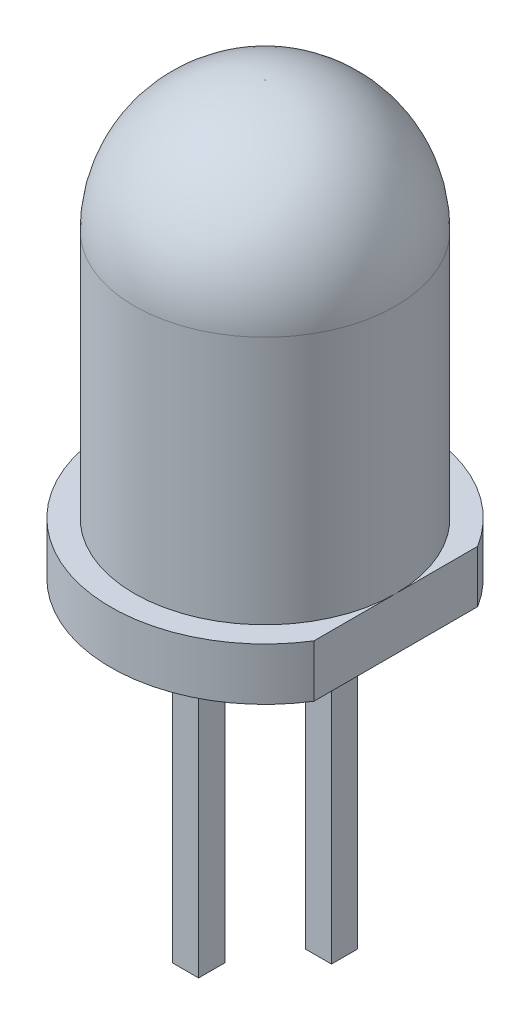
ISO-10303-21;
HEADER;
FILE_DESCRIPTION(('STEP AP214'),'2;1');
FILE_NAME('part.step','',(''),(''),'','','');
FILE_SCHEMA(('AUTOMOTIVE_DESIGN { 1 0 10303 214 1 1 1 1 }'));
ENDSEC;
DATA;
#1=APPLICATION_CONTEXT('core data for automotive mechanical design processes');
#2=APPLICATION_PROTOCOL_DEFINITION('international standard','automotive_design',2000,#1);
#3=PRODUCT_CONTEXT('',#1,'mechanical');
#4=PRODUCT('Part','Part','',(#3));
#5=PRODUCT_RELATED_PRODUCT_CATEGORY('part','',(#4));
#6=PRODUCT_DEFINITION_FORMATION('','',#4);
#7=PRODUCT_DEFINITION_CONTEXT('part definition',#1,'design');
#8=PRODUCT_DEFINITION('design','',#6,#7);
#9=PRODUCT_DEFINITION_SHAPE('','',#8);
#10=(LENGTH_UNIT() NAMED_UNIT(*) SI_UNIT(.MILLI.,.METRE.));
#11=(NAMED_UNIT(*) PLANE_ANGLE_UNIT() SI_UNIT($,.RADIAN.));
#12=(NAMED_UNIT(*) SI_UNIT($,.STERADIAN.) SOLID_ANGLE_UNIT());
#13=UNCERTAINTY_MEASURE_WITH_UNIT(LENGTH_MEASURE(1.E-05),#10,'distance_accuracy_value','');
#14=(GEOMETRIC_REPRESENTATION_CONTEXT(3) GLOBAL_UNCERTAINTY_ASSIGNED_CONTEXT((#13)) GLOBAL_UNIT_ASSIGNED_CONTEXT((#10,
#11,#12)) REPRESENTATION_CONTEXT('',''));
#15=CARTESIAN_POINT('',(0.,0.,0.));
#16=DIRECTION('',(0.,0.,1.));
#17=DIRECTION('',(1.,0.,0.));
#18=AXIS2_PLACEMENT_3D('',#15,#16,#17);
#19=CARTESIAN_POINT('',(0.520172722818679,-0.5,0.));
#20=DIRECTION('',(0.,0.,-1.));
#21=DIRECTION('',(-1.,0.,0.));
#22=AXIS2_PLACEMENT_3D('',#19,#20,#21);
#23=CYLINDRICAL_SURFACE('',#22,0.5);
#24=CARTESIAN_POINT('',(0.520172722818679,-0.5,0.75));
#25=DIRECTION('',(-0.707106781186547,0.,-0.707106781186547));
#26=DIRECTION('',(-0.707106781186547,0.,0.707106781186547));
#27=AXIS2_PLACEMENT_3D('',#24,#25,#26);
#28=ELLIPSE('',#27,0.707106781186547,0.5);
#29=CARTESIAN_POINT('',(0.520172722818679,0.,0.75));
#30=VERTEX_POINT('',#29);
#31=CARTESIAN_POINT('',(1.02017272281868,-0.5,0.25));
#32=VERTEX_POINT('',#31);
#33=EDGE_CURVE('E226',#30,#32,#28,.T.);
#34=ORIENTED_EDGE('',*,*,#33,.F.);
#35=DIRECTION('',(0.,0.,1.));
#36=VECTOR('',#35,1.);
#37=CARTESIAN_POINT('',(0.520172722818679,0.,0.));
#38=LINE('',#37,#36);
#39=CARTESIAN_POINT('',(0.520172722818679,0.,-0.75));
#40=VERTEX_POINT('',#39);
#41=EDGE_CURVE('E198',#40,#30,#38,.T.);
#42=ORIENTED_EDGE('',*,*,#41,.F.);
#43=CARTESIAN_POINT('',(0.520172722818679,-0.5,-0.75));
#44=DIRECTION('',(0.707106781186547,0.,-0.707106781186547));
#45=DIRECTION('',(-0.707106781186547,0.,-0.707106781186547));
#46=AXIS2_PLACEMENT_3D('',#43,#44,#45);
#47=ELLIPSE('',#46,0.707106781186547,0.5);
#48=CARTESIAN_POINT('',(1.02017272281868,-0.5,-0.25));
#49=VERTEX_POINT('',#48);
#50=EDGE_CURVE('E59',#40,#49,#47,.T.);
#51=ORIENTED_EDGE('',*,*,#50,.T.);
#52=DIRECTION('',(0.,0.,1.));
#53=VECTOR('',#52,1.);
#54=CARTESIAN_POINT('',(1.02017272281868,-0.5,0.));
#55=LINE('',#54,#53);
#56=EDGE_CURVE('E219',#32,#49,#55,.F.);
#57=ORIENTED_EDGE('',*,*,#56,.F.);
#58=EDGE_LOOP('',(#34,#42,#51,#57));
#59=FACE_BOUND('',#58,.T.);
#60=ADVANCED_FACE('F36',(#59),#23,.F.);
#61=CARTESIAN_POINT('',(0.,-0.5,-0.75));
#62=DIRECTION('',(1.,0.,0.));
#63=DIRECTION('',(0.,0.,-1.));
#64=AXIS2_PLACEMENT_3D('',#61,#62,#63);
#65=CYLINDRICAL_SURFACE('',#64,0.5);
#66=ORIENTED_EDGE('',*,*,#50,.F.);
#67=DIRECTION('',(-1.,0.,0.));
#68=VECTOR('',#67,1.);
#69=CARTESIAN_POINT('',(0.,0.,-0.75));
#70=LINE('',#69,#68);
#71=CARTESIAN_POINT('',(2.02017272281868,0.,-0.75));
#72=VERTEX_POINT('',#71);
#73=EDGE_CURVE('E201',#72,#40,#70,.T.);
#74=ORIENTED_EDGE('',*,*,#73,.F.);
#75=CARTESIAN_POINT('',(2.02017272281868,-0.5,-0.75));
#76=DIRECTION('',(0.707106781186547,0.,0.707106781186547));
#77=DIRECTION('',(0.707106781186547,0.,-0.707106781186547));
#78=AXIS2_PLACEMENT_3D('',#75,#76,#77);
#79=ELLIPSE('',#78,0.707106781186547,0.5);
#80=CARTESIAN_POINT('',(1.52017272281868,-0.5,-0.25));
#81=VERTEX_POINT('',#80);
#82=EDGE_CURVE('E223',#72,#81,#79,.T.);
#83=ORIENTED_EDGE('',*,*,#82,.T.);
#84=DIRECTION('',(-1.,0.,0.));
#85=VECTOR('',#84,1.);
#86=CARTESIAN_POINT('',(0.,-0.5,-0.25));
#87=LINE('',#86,#85);
#88=EDGE_CURVE('E216',#49,#81,#87,.F.);
#89=ORIENTED_EDGE('',*,*,#88,.F.);
#90=EDGE_LOOP('',(#66,#74,#83,#89));
#91=FACE_BOUND('',#90,.T.);
#92=ADVANCED_FACE('F242',(#91),#65,.F.);
#93=CARTESIAN_POINT('',(2.02017272281868,-0.5,0.));
#94=DIRECTION('',(0.,0.,1.));
#95=DIRECTION('',(1.,0.,0.));
#96=AXIS2_PLACEMENT_3D('',#93,#94,#95);
#97=CYLINDRICAL_SURFACE('',#96,0.5);
#98=ORIENTED_EDGE('',*,*,#82,.F.);
#99=DIRECTION('',(0.,0.,-1.));
#100=VECTOR('',#99,1.);
#101=CARTESIAN_POINT('',(2.02017272281868,0.,0.));
#102=LINE('',#101,#100);
#103=CARTESIAN_POINT('',(2.02017272281868,0.,0.75));
#104=VERTEX_POINT('',#103);
#105=EDGE_CURVE('E204',#104,#72,#102,.T.);
#106=ORIENTED_EDGE('',*,*,#105,.F.);
#107=CARTESIAN_POINT('',(2.02017272281868,-0.5,0.75));
#108=DIRECTION('',(-0.707106781186547,0.,0.707106781186547));
#109=DIRECTION('',(0.707106781186547,0.,0.707106781186547));
#110=AXIS2_PLACEMENT_3D('',#107,#108,#109);
#111=ELLIPSE('',#110,0.707106781186547,0.5);
#112=CARTESIAN_POINT('',(1.52017272281868,-0.5,0.25));
#113=VERTEX_POINT('',#112);
#114=EDGE_CURVE('E221',#104,#113,#111,.T.);
#115=ORIENTED_EDGE('',*,*,#114,.T.);
#116=DIRECTION('',(0.,0.,-1.));
#117=VECTOR('',#116,1.);
#118=CARTESIAN_POINT('',(1.52017272281868,-0.5,0.));
#119=LINE('',#118,#117);
#120=EDGE_CURVE('E213',#81,#113,#119,.F.);
#121=ORIENTED_EDGE('',*,*,#120,.F.);
#122=EDGE_LOOP('',(#98,#106,#115,#121));
#123=FACE_BOUND('',#122,.T.);
#124=ADVANCED_FACE('F246',(#123),#97,.F.);
#125=CARTESIAN_POINT('',(0.,-0.5,0.75));
#126=DIRECTION('',(-1.,0.,0.));
#127=DIRECTION('',(0.,0.,1.));
#128=AXIS2_PLACEMENT_3D('',#125,#126,#127);
#129=CYLINDRICAL_SURFACE('',#128,0.5);
#130=DIRECTION('',(1.,0.,0.));
#131=VECTOR('',#130,1.);
#132=CARTESIAN_POINT('',(0.,0.,0.75));
#133=LINE('',#132,#131);
#134=EDGE_CURVE('E207',#30,#104,#133,.T.);
#135=ORIENTED_EDGE('',*,*,#134,.F.);
#136=ORIENTED_EDGE('',*,*,#33,.T.);
#137=DIRECTION('',(1.,0.,0.));
#138=VECTOR('',#137,1.);
#139=CARTESIAN_POINT('',(0.,-0.5,0.25));
#140=LINE('',#139,#138);
#141=EDGE_CURVE('E210',#113,#32,#140,.F.);
#142=ORIENTED_EDGE('',*,*,#141,.F.);
#143=ORIENTED_EDGE('',*,*,#114,.F.);
#144=EDGE_LOOP('',(#135,#136,#142,#143));
#145=FACE_BOUND('',#144,.T.);
#146=ADVANCED_FACE('F252',(#145),#129,.F.);
#147=CARTESIAN_POINT('',(0.,-0.5,0.75));
#148=DIRECTION('',(-1.,0.,0.));
#149=DIRECTION('',(0.,0.,1.));
#150=AXIS2_PLACEMENT_3D('',#147,#148,#149);
#151=CYLINDRICAL_SURFACE('',#150,0.5);
#152=CARTESIAN_POINT('',(-0.520142923068885,-0.5,0.75));
#153=DIRECTION('',(-0.707106781186547,0.,0.707106781186547));
#154=DIRECTION('',(0.707106781186547,0.,0.707106781186547));
#155=AXIS2_PLACEMENT_3D('',#152,#153,#154);
#156=ELLIPSE('',#155,0.707106781186547,0.5);
#157=CARTESIAN_POINT('',(-0.520142923068885,0.,0.75));
#158=VERTEX_POINT('',#157);
#159=CARTESIAN_POINT('',(-1.02014292306889,-0.5,0.25));
#160=VERTEX_POINT('',#159);
#161=EDGE_CURVE('E196',#158,#160,#156,.T.);
#162=ORIENTED_EDGE('',*,*,#161,.F.);
#163=DIRECTION('',(1.,0.,0.));
#164=VECTOR('',#163,1.);
#165=CARTESIAN_POINT('',(0.,0.,0.75));
#166=LINE('',#165,#164);
#167=CARTESIAN_POINT('',(-2.02014292306889,0.,0.75));
#168=VERTEX_POINT('',#167);
#169=EDGE_CURVE('E160',#168,#158,#166,.T.);
#170=ORIENTED_EDGE('',*,*,#169,.F.);
#171=CARTESIAN_POINT('',(-2.02014292306889,-0.5,0.75));
#172=DIRECTION('',(-0.707106781186547,0.,-0.707106781186547));
#173=DIRECTION('',(-0.707106781186547,0.,0.707106781186547));
#174=AXIS2_PLACEMENT_3D('',#171,#172,#173);
#175=ELLIPSE('',#174,0.707106781186547,0.5);
#176=CARTESIAN_POINT('',(-1.52014292306889,-0.5,0.25));
#177=VERTEX_POINT('',#176);
#178=EDGE_CURVE('E194',#168,#177,#175,.T.);
#179=ORIENTED_EDGE('',*,*,#178,.T.);
#180=DIRECTION('',(1.,0.,0.));
#181=VECTOR('',#180,1.);
#182=CARTESIAN_POINT('',(0.,-0.5,0.25));
#183=LINE('',#182,#181);
#184=EDGE_CURVE('E187',#160,#177,#183,.F.);
#185=ORIENTED_EDGE('',*,*,#184,.F.);
#186=EDGE_LOOP('',(#162,#170,#179,#185));
#187=FACE_BOUND('',#186,.T.);
#188=ADVANCED_FACE('F256',(#187),#151,.F.);
#189=CARTESIAN_POINT('',(-2.02014292306889,-0.5,0.));
#190=DIRECTION('',(0.,0.,-1.));
#191=DIRECTION('',(-1.,0.,0.));
#192=AXIS2_PLACEMENT_3D('',#189,#190,#191);
#193=CYLINDRICAL_SURFACE('',#192,0.5);
#194=ORIENTED_EDGE('',*,*,#178,.F.);
#195=DIRECTION('',(0.,0.,1.));
#196=VECTOR('',#195,1.);
#197=CARTESIAN_POINT('',(-2.02014292306889,0.,0.));
#198=LINE('',#197,#196);
#199=CARTESIAN_POINT('',(-2.02014292306889,0.,-0.75));
#200=VERTEX_POINT('',#199);
#201=EDGE_CURVE('E164',#200,#168,#198,.T.);
#202=ORIENTED_EDGE('',*,*,#201,.F.);
#203=CARTESIAN_POINT('',(-2.02014292306889,-0.5,-0.75));
#204=DIRECTION('',(0.707106781186547,0.,-0.707106781186547));
#205=DIRECTION('',(-0.707106781186547,0.,-0.707106781186547));
#206=AXIS2_PLACEMENT_3D('',#203,#204,#205);
#207=ELLIPSE('',#206,0.707106781186547,0.5);
#208=CARTESIAN_POINT('',(-1.52014292306889,-0.5,-0.25));
#209=VERTEX_POINT('',#208);
#210=EDGE_CURVE('E192',#200,#209,#207,.T.);
#211=ORIENTED_EDGE('',*,*,#210,.T.);
#212=DIRECTION('',(0.,0.,1.));
#213=VECTOR('',#212,1.);
#214=CARTESIAN_POINT('',(-1.52014292306889,-0.5,0.));
#215=LINE('',#214,#213);
#216=EDGE_CURVE('E184',#177,#209,#215,.F.);
#217=ORIENTED_EDGE('',*,*,#216,.F.);
#218=EDGE_LOOP('',(#194,#202,#211,#217));
#219=FACE_BOUND('',#218,.T.);
#220=ADVANCED_FACE('F260',(#219),#193,.F.);
#221=CARTESIAN_POINT('',(0.,-0.5,-0.75));
#222=DIRECTION('',(1.,0.,0.));
#223=DIRECTION('',(0.,0.,-1.));
#224=AXIS2_PLACEMENT_3D('',#221,#222,#223);
#225=CYLINDRICAL_SURFACE('',#224,0.5);
#226=ORIENTED_EDGE('',*,*,#210,.F.);
#227=DIRECTION('',(-1.,0.,0.));
#228=VECTOR('',#227,1.);
#229=CARTESIAN_POINT('',(0.,0.,-0.75));
#230=LINE('',#229,#228);
#231=CARTESIAN_POINT('',(-0.520142923068885,0.,-0.75));
#232=VERTEX_POINT('',#231);
#233=EDGE_CURVE('E172',#232,#200,#230,.T.);
#234=ORIENTED_EDGE('',*,*,#233,.F.);
#235=CARTESIAN_POINT('',(-0.520142923068885,-0.5,-0.75));
#236=DIRECTION('',(0.707106781186547,0.,0.707106781186547));
#237=DIRECTION('',(0.707106781186547,0.,-0.707106781186547));
#238=AXIS2_PLACEMENT_3D('',#235,#236,#237);
#239=ELLIPSE('',#238,0.707106781186547,0.5);
#240=CARTESIAN_POINT('',(-1.02014292306889,-0.5,-0.25));
#241=VERTEX_POINT('',#240);
#242=EDGE_CURVE('E190',#232,#241,#239,.T.);
#243=ORIENTED_EDGE('',*,*,#242,.T.);
#244=DIRECTION('',(-1.,0.,0.));
#245=VECTOR('',#244,1.);
#246=CARTESIAN_POINT('',(0.,-0.5,-0.25));
#247=LINE('',#246,#245);
#248=EDGE_CURVE('E181',#209,#241,#247,.F.);
#249=ORIENTED_EDGE('',*,*,#248,.F.);
#250=EDGE_LOOP('',(#226,#234,#243,#249));
#251=FACE_BOUND('',#250,.T.);
#252=ADVANCED_FACE('F264',(#251),#225,.F.);
#253=CARTESIAN_POINT('',(-0.520142923068885,-0.5,0.));
#254=DIRECTION('',(0.,0.,1.));
#255=DIRECTION('',(1.,0.,0.));
#256=AXIS2_PLACEMENT_3D('',#253,#254,#255);
#257=CYLINDRICAL_SURFACE('',#256,0.5);
#258=DIRECTION('',(0.,0.,-1.));
#259=VECTOR('',#258,1.);
#260=CARTESIAN_POINT('',(-0.520142923068885,0.,0.));
#261=LINE('',#260,#259);
#262=EDGE_CURVE('E175',#158,#232,#261,.T.);
#263=ORIENTED_EDGE('',*,*,#262,.F.);
#264=ORIENTED_EDGE('',*,*,#161,.T.);
#265=DIRECTION('',(0.,0.,-1.));
#266=VECTOR('',#265,1.);
#267=CARTESIAN_POINT('',(-1.02014292306889,-0.5,0.));
#268=LINE('',#267,#266);
#269=EDGE_CURVE('E178',#241,#160,#268,.F.);
#270=ORIENTED_EDGE('',*,*,#269,.F.);
#271=ORIENTED_EDGE('',*,*,#242,.F.);
#272=EDGE_LOOP('',(#263,#264,#270,#271));
#273=FACE_BOUND('',#272,.T.);
#274=ADVANCED_FACE('F268',(#273),#257,.F.);
#275=CARTESIAN_POINT('',(1.02017272281868,-7.,-0.25));
#276=DIRECTION('',(1.,0.,0.));
#277=DIRECTION('',(0.,0.,-1.));
#278=AXIS2_PLACEMENT_3D('',#275,#276,#277);
#279=PLANE('',#278);
#280=DIRECTION('',(0.,1.,0.));
#281=VECTOR('',#280,1.);
#282=CARTESIAN_POINT('',(1.02017272281868,-7.,0.25));
#283=LINE('',#282,#281);
#284=CARTESIAN_POINT('',(1.02017272281868,-5.5,0.25));
#285=VERTEX_POINT('',#284);
#286=EDGE_CURVE('E340',#285,#32,#283,.T.);
#287=ORIENTED_EDGE('',*,*,#286,.T.);
#288=ORIENTED_EDGE('',*,*,#56,.T.);
#289=DIRECTION('',(0.,1.,0.));
#290=VECTOR('',#289,1.);
#291=CARTESIAN_POINT('',(1.02017272281868,-7.,-0.25));
#292=LINE('',#291,#290);
#293=CARTESIAN_POINT('',(1.02017272281868,-5.5,-0.25));
#294=VERTEX_POINT('',#293);
#295=EDGE_CURVE('E342',#294,#49,#292,.T.);
#296=ORIENTED_EDGE('',*,*,#295,.F.);
#297=DIRECTION('',(0.,0.,-1.));
#298=VECTOR('',#297,1.);
#299=CARTESIAN_POINT('',(1.02017272281868,-5.5,0.25));
#300=LINE('',#299,#298);
#301=EDGE_CURVE('E330',#285,#294,#300,.T.);
#302=ORIENTED_EDGE('',*,*,#301,.F.);
#303=EDGE_LOOP('',(#287,#288,#296,#302));
#304=FACE_BOUND('',#303,.T.);
#305=ADVANCED_FACE('F272',(#304),#279,.F.);
#306=CARTESIAN_POINT('',(1.02017272281868,-7.,-0.25));
#307=DIRECTION('',(0.,0.,1.));
#308=DIRECTION('',(1.,0.,0.));
#309=AXIS2_PLACEMENT_3D('',#306,#307,#308);
#310=PLANE('',#309);
#311=ORIENTED_EDGE('',*,*,#295,.T.);
#312=ORIENTED_EDGE('',*,*,#88,.T.);
#313=DIRECTION('',(0.,1.,0.));
#314=VECTOR('',#313,1.);
#315=CARTESIAN_POINT('',(1.52017272281868,-7.,-0.25));
#316=LINE('',#315,#314);
#317=CARTESIAN_POINT('',(1.52017272281868,-5.5,-0.25));
#318=VERTEX_POINT('',#317);
#319=EDGE_CURVE('E348',#318,#81,#316,.T.);
#320=ORIENTED_EDGE('',*,*,#319,.F.);
#321=DIRECTION('',(1.,0.,0.));
#322=VECTOR('',#321,1.);
#323=CARTESIAN_POINT('',(1.02017272281868,-5.5,-0.25));
#324=LINE('',#323,#322);
#325=EDGE_CURVE('E343',#294,#318,#324,.T.);
#326=ORIENTED_EDGE('',*,*,#325,.F.);
#327=EDGE_LOOP('',(#311,#312,#320,#326));
#328=FACE_BOUND('',#327,.T.);
#329=ADVANCED_FACE('F311',(#328),#310,.F.);
#330=CARTESIAN_POINT('',(1.52017272281868,-7.,-0.25));
#331=DIRECTION('',(-1.,0.,0.));
#332=DIRECTION('',(0.,0.,1.));
#333=AXIS2_PLACEMENT_3D('',#330,#331,#332);
#334=PLANE('',#333);
#335=ORIENTED_EDGE('',*,*,#319,.T.);
#336=ORIENTED_EDGE('',*,*,#120,.T.);
#337=DIRECTION('',(0.,1.,0.));
#338=VECTOR('',#337,1.);
#339=CARTESIAN_POINT('',(1.52017272281868,-7.,0.25));
#340=LINE('',#339,#338);
#341=CARTESIAN_POINT('',(1.52017272281868,-5.5,0.25));
#342=VERTEX_POINT('',#341);
#343=EDGE_CURVE('E346',#342,#113,#340,.T.);
#344=ORIENTED_EDGE('',*,*,#343,.F.);
#345=DIRECTION('',(0.,0.,1.));
#346=VECTOR('',#345,1.);
#347=CARTESIAN_POINT('',(1.52017272281868,-5.5,-0.25));
#348=LINE('',#347,#346);
#349=EDGE_CURVE('E333',#318,#342,#348,.T.);
#350=ORIENTED_EDGE('',*,*,#349,.F.);
#351=EDGE_LOOP('',(#335,#336,#344,#350));
#352=FACE_BOUND('',#351,.T.);
#353=ADVANCED_FACE('F315',(#352),#334,.F.);
#354=CARTESIAN_POINT('',(1.02017272281868,-7.,0.25));
#355=DIRECTION('',(0.,0.,-1.));
#356=DIRECTION('',(-1.,0.,0.));
#357=AXIS2_PLACEMENT_3D('',#354,#355,#356);
#358=PLANE('',#357);
#359=ORIENTED_EDGE('',*,*,#343,.T.);
#360=ORIENTED_EDGE('',*,*,#141,.T.);
#361=ORIENTED_EDGE('',*,*,#286,.F.);
#362=DIRECTION('',(-1.,0.,0.));
#363=VECTOR('',#362,1.);
#364=CARTESIAN_POINT('',(1.52017272281868,-5.5,0.25));
#365=LINE('',#364,#363);
#366=EDGE_CURVE('E328',#342,#285,#365,.T.);
#367=ORIENTED_EDGE('',*,*,#366,.F.);
#368=EDGE_LOOP('',(#359,#360,#361,#367));
#369=FACE_BOUND('',#368,.T.);
#370=ADVANCED_FACE('F280',(#369),#358,.F.);
#371=CARTESIAN_POINT('',(0.,0.,0.));
#372=DIRECTION('',(0.,1.,0.));
#373=DIRECTION('',(0.,0.,1.));
#374=AXIS2_PLACEMENT_3D('',#371,#372,#373);
#375=PLANE('',#374);
#376=ORIENTED_EDGE('',*,*,#41,.T.);
#377=ORIENTED_EDGE('',*,*,#134,.T.);
#378=ORIENTED_EDGE('',*,*,#105,.T.);
#379=ORIENTED_EDGE('',*,*,#73,.T.);
#380=EDGE_LOOP('',(#376,#377,#378,#379));
#381=FACE_BOUND('',#380,.T.);
#382=ORIENTED_EDGE('',*,*,#169,.T.);
#383=ORIENTED_EDGE('',*,*,#262,.T.);
#384=ORIENTED_EDGE('',*,*,#233,.T.);
#385=ORIENTED_EDGE('',*,*,#201,.T.);
#386=EDGE_LOOP('',(#382,#383,#384,#385));
#387=FACE_BOUND('',#386,.T.);
#388=CARTESIAN_POINT('',(0.,0.,0.));
#389=DIRECTION('',(0.,1.,0.));
#390=DIRECTION('',(0.,0.,1.));
#391=AXIS2_PLACEMENT_3D('',#388,#389,#390);
#392=CIRCLE('',#391,2.95);
#393=CARTESIAN_POINT('',(2.5,0.,-1.56604597633658));
#394=VERTEX_POINT('',#393);
#395=CARTESIAN_POINT('',(2.5,0.,1.56604597633658));
#396=VERTEX_POINT('',#395);
#397=EDGE_CURVE('E161',#394,#396,#392,.T.);
#398=ORIENTED_EDGE('',*,*,#397,.F.);
#399=DIRECTION('',(0.,0.,-1.));
#400=VECTOR('',#399,1.);
#401=CARTESIAN_POINT('',(2.5,0.,-2.73044739038099));
#402=LINE('',#401,#400);
#403=EDGE_CURVE('E144',#396,#394,#402,.T.);
#404=ORIENTED_EDGE('',*,*,#403,.F.);
#405=EDGE_LOOP('',(#398,#404));
#406=FACE_BOUND('',#405,.T.);
#407=ADVANCED_FACE('F277',(#381,#387,#406),#375,.F.);
#408=CARTESIAN_POINT('',(0.,1.,0.));
#409=DIRECTION('',(0.,1.,0.));
#410=DIRECTION('',(0.,0.,1.));
#411=AXIS2_PLACEMENT_3D('',#408,#409,#410);
#412=PLANE('',#411);
#413=DIRECTION('',(0.,0.,1.));
#414=VECTOR('',#413,1.);
#415=CARTESIAN_POINT('',(2.5,1.,-2.73044739038099));
#416=LINE('',#415,#414);
#417=CARTESIAN_POINT('',(2.5,1.,-1.56604597633658));
#418=VERTEX_POINT('',#417);
#419=CARTESIAN_POINT('',(2.5,1.,0.));
#420=VERTEX_POINT('',#419);
#421=EDGE_CURVE('E142',#418,#420,#416,.T.);
#422=ORIENTED_EDGE('',*,*,#421,.F.);
#423=CARTESIAN_POINT('',(0.,1.,0.));
#424=DIRECTION('',(0.,1.,0.));
#425=DIRECTION('',(0.,0.,1.));
#426=AXIS2_PLACEMENT_3D('',#423,#424,#425);
#427=CIRCLE('',#426,2.95);
#428=CARTESIAN_POINT('',(2.5,1.,1.56604597633658));
#429=VERTEX_POINT('',#428);
#430=EDGE_CURVE('E155',#418,#429,#427,.T.);
#431=ORIENTED_EDGE('',*,*,#430,.T.);
#432=EDGE_CURVE('E51',#420,#429,#416,.T.);
#433=ORIENTED_EDGE('',*,*,#432,.F.);
#434=CARTESIAN_POINT('',(0.,1.,0.));
#435=DIRECTION('',(0.,1.,0.));
#436=DIRECTION('',(0.,0.,1.));
#437=AXIS2_PLACEMENT_3D('',#434,#435,#436);
#438=CIRCLE('',#437,2.5);
#439=EDGE_CURVE('E157',#420,#420,#438,.T.);
#440=ORIENTED_EDGE('',*,*,#439,.F.);
#441=EDGE_LOOP('',(#422,#431,#433,#440));
#442=FACE_BOUND('',#441,.T.);
#443=ADVANCED_FACE('F154',(#442),#412,.T.);
#444=CARTESIAN_POINT('',(0.,1.,0.));
#445=DIRECTION('',(0.,-1.,0.));
#446=DIRECTION('',(0.,0.,-1.));
#447=AXIS2_PLACEMENT_3D('',#444,#445,#446);
#448=CYLINDRICAL_SURFACE('',#447,2.95);
#449=ORIENTED_EDGE('',*,*,#430,.F.);
#450=DIRECTION('',(0.,-1.,0.));
#451=VECTOR('',#450,1.);
#452=CARTESIAN_POINT('',(2.5,1.,-1.56604597633659));
#453=LINE('',#452,#451);
#454=EDGE_CURVE('E139',#418,#394,#453,.T.);
#455=ORIENTED_EDGE('',*,*,#454,.T.);
#456=ORIENTED_EDGE('',*,*,#397,.T.);
#457=DIRECTION('',(0.,-1.,0.));
#458=VECTOR('',#457,1.);
#459=CARTESIAN_POINT('',(2.5,1.,1.56604597633658));
#460=LINE('',#459,#458);
#461=EDGE_CURVE('E149',#396,#429,#460,.F.);
#462=ORIENTED_EDGE('',*,*,#461,.T.);
#463=EDGE_LOOP('',(#449,#455,#456,#462));
#464=FACE_BOUND('',#463,.T.);
#465=ADVANCED_FACE('F159',(#464),#448,.T.);
#466=CARTESIAN_POINT('',(0.,8.25,0.));
#467=DIRECTION('',(0.,-1.,0.));
#468=DIRECTION('',(0.,0.,-1.));
#469=AXIS2_PLACEMENT_3D('',#466,#467,#468);
#470=CYLINDRICAL_SURFACE('',#469,2.5);
#471=CARTESIAN_POINT('',(0.,5.75999999999978,0.));
#472=DIRECTION('',(0.,1.,0.));
#473=DIRECTION('',(0.,0.,1.));
#474=AXIS2_PLACEMENT_3D('',#471,#472,#473);
#475=CIRCLE('',#474,2.5);
#476=CARTESIAN_POINT('',(0.,5.75999999999978,2.5));
#477=VERTEX_POINT('',#476);
#478=EDGE_CURVE('E12',#477,#477,#475,.F.);
#479=ORIENTED_EDGE('',*,*,#478,.T.);
#480=EDGE_LOOP('',(#479));
#481=FACE_BOUND('',#480,.T.);
#482=ORIENTED_EDGE('',*,*,#439,.T.);
#483=EDGE_LOOP('',(#482));
#484=FACE_BOUND('',#483,.T.);
#485=ADVANCED_FACE('F276',(#481,#484),#470,.T.);
#486=CARTESIAN_POINT('',(0.,8.25,0.));
#487=DIRECTION('',(0.,1.,0.));
#488=DIRECTION('',(0.,0.,1.));
#489=AXIS2_PLACEMENT_3D('',#486,#487,#488);
#490=PLANE('',#489);
#491=CARTESIAN_POINT('',(0.,8.25,0.));
#492=DIRECTION('',(0.,1.,0.));
#493=DIRECTION('',(0.,0.,1.));
#494=AXIS2_PLACEMENT_3D('',#491,#492,#493);
#495=CIRCLE('',#494,0.01);
#496=CARTESIAN_POINT('',(0.,8.25,0.01));
#497=VERTEX_POINT('',#496);
#498=EDGE_CURVE('E44',#497,#497,#495,.T.);
#499=ORIENTED_EDGE('',*,*,#498,.T.);
#500=EDGE_LOOP('',(#499));
#501=FACE_BOUND('',#500,.T.);
#502=ADVANCED_FACE('F231',(#501),#490,.T.);
#503=CARTESIAN_POINT('',(-1.52014292306889,-7.,-0.25));
#504=DIRECTION('',(1.,0.,0.));
#505=DIRECTION('',(0.,0.,-1.));
#506=AXIS2_PLACEMENT_3D('',#503,#504,#505);
#507=PLANE('',#506);
#508=DIRECTION('',(0.,1.,0.));
#509=VECTOR('',#508,1.);
#510=CARTESIAN_POINT('',(-1.52014292306889,-7.,0.25));
#511=LINE('',#510,#509);
#512=CARTESIAN_POINT('',(-1.52014292306889,-7.,0.25));
#513=VERTEX_POINT('',#512);
#514=EDGE_CURVE('E365',#513,#177,#511,.T.);
#515=ORIENTED_EDGE('',*,*,#514,.T.);
#516=ORIENTED_EDGE('',*,*,#216,.T.);
#517=DIRECTION('',(0.,1.,0.));
#518=VECTOR('',#517,1.);
#519=CARTESIAN_POINT('',(-1.52014292306889,-7.,-0.25));
#520=LINE('',#519,#518);
#521=CARTESIAN_POINT('',(-1.52014292306889,-7.,-0.25));
#522=VERTEX_POINT('',#521);
#523=EDGE_CURVE('E373',#522,#209,#520,.T.);
#524=ORIENTED_EDGE('',*,*,#523,.F.);
#525=DIRECTION('',(0.,0.,-1.));
#526=VECTOR('',#525,1.);
#527=CARTESIAN_POINT('',(-1.52014292306889,-7.,-0.25));
#528=LINE('',#527,#526);
#529=EDGE_CURVE('E356',#513,#522,#528,.T.);
#530=ORIENTED_EDGE('',*,*,#529,.F.);
#531=EDGE_LOOP('',(#515,#516,#524,#530));
#532=FACE_BOUND('',#531,.T.);
#533=ADVANCED_FACE('F289',(#532),#507,.F.);
#534=CARTESIAN_POINT('',(-1.52014292306889,-7.,-0.25));
#535=DIRECTION('',(0.,0.,1.));
#536=DIRECTION('',(1.,0.,0.));
#537=AXIS2_PLACEMENT_3D('',#534,#535,#536);
#538=PLANE('',#537);
#539=ORIENTED_EDGE('',*,*,#523,.T.);
#540=ORIENTED_EDGE('',*,*,#248,.T.);
#541=DIRECTION('',(0.,1.,0.));
#542=VECTOR('',#541,1.);
#543=CARTESIAN_POINT('',(-1.02014292306889,-7.,-0.25));
#544=LINE('',#543,#542);
#545=CARTESIAN_POINT('',(-1.02014292306889,-7.,-0.25));
#546=VERTEX_POINT('',#545);
#547=EDGE_CURVE('E371',#546,#241,#544,.T.);
#548=ORIENTED_EDGE('',*,*,#547,.F.);
#549=DIRECTION('',(1.,0.,0.));
#550=VECTOR('',#549,1.);
#551=CARTESIAN_POINT('',(-1.52014292306889,-7.,-0.25));
#552=LINE('',#551,#550);
#553=EDGE_CURVE('E359',#522,#546,#552,.T.);
#554=ORIENTED_EDGE('',*,*,#553,.F.);
#555=EDGE_LOOP('',(#539,#540,#548,#554));
#556=FACE_BOUND('',#555,.T.);
#557=ADVANCED_FACE('F292',(#556),#538,.F.);
#558=CARTESIAN_POINT('',(-1.02014292306889,-7.,-0.25));
#559=DIRECTION('',(-1.,0.,0.));
#560=DIRECTION('',(0.,0.,1.));
#561=AXIS2_PLACEMENT_3D('',#558,#559,#560);
#562=PLANE('',#561);
#563=ORIENTED_EDGE('',*,*,#547,.T.);
#564=ORIENTED_EDGE('',*,*,#269,.T.);
#565=DIRECTION('',(0.,1.,0.));
#566=VECTOR('',#565,1.);
#567=CARTESIAN_POINT('',(-1.02014292306889,-7.,0.25));
#568=LINE('',#567,#566);
#569=CARTESIAN_POINT('',(-1.02014292306889,-7.,0.25));
#570=VERTEX_POINT('',#569);
#571=EDGE_CURVE('E368',#570,#160,#568,.T.);
#572=ORIENTED_EDGE('',*,*,#571,.F.);
#573=DIRECTION('',(0.,0.,1.));
#574=VECTOR('',#573,1.);
#575=CARTESIAN_POINT('',(-1.02014292306889,-7.,-0.25));
#576=LINE('',#575,#574);
#577=EDGE_CURVE('E361',#546,#570,#576,.T.);
#578=ORIENTED_EDGE('',*,*,#577,.F.);
#579=EDGE_LOOP('',(#563,#564,#572,#578));
#580=FACE_BOUND('',#579,.T.);
#581=ADVANCED_FACE('F296',(#580),#562,.F.);
#582=CARTESIAN_POINT('',(-1.52014292306889,-7.,0.25));
#583=DIRECTION('',(0.,0.,-1.));
#584=DIRECTION('',(-1.,0.,0.));
#585=AXIS2_PLACEMENT_3D('',#582,#583,#584);
#586=PLANE('',#585);
#587=ORIENTED_EDGE('',*,*,#571,.T.);
#588=ORIENTED_EDGE('',*,*,#184,.T.);
#589=ORIENTED_EDGE('',*,*,#514,.F.);
#590=DIRECTION('',(-1.,0.,0.));
#591=VECTOR('',#590,1.);
#592=CARTESIAN_POINT('',(-1.52014292306889,-7.,0.25));
#593=LINE('',#592,#591);
#594=EDGE_CURVE('E363',#570,#513,#593,.T.);
#595=ORIENTED_EDGE('',*,*,#594,.F.);
#596=EDGE_LOOP('',(#587,#588,#589,#595));
#597=FACE_BOUND('',#596,.T.);
#598=ADVANCED_FACE('F300',(#597),#586,.F.);
#599=CARTESIAN_POINT('',(-1.52014292306889,-7.,0.25));
#600=DIRECTION('',(0.,1.,0.));
#601=DIRECTION('',(0.,0.,1.));
#602=AXIS2_PLACEMENT_3D('',#599,#600,#601);
#603=PLANE('',#602);
#604=ORIENTED_EDGE('',*,*,#529,.T.);
#605=ORIENTED_EDGE('',*,*,#553,.T.);
#606=ORIENTED_EDGE('',*,*,#577,.T.);
#607=ORIENTED_EDGE('',*,*,#594,.T.);
#608=EDGE_LOOP('',(#604,#605,#606,#607));
#609=FACE_BOUND('',#608,.T.);
#610=ADVANCED_FACE('F304',(#609),#603,.F.);
#611=CARTESIAN_POINT('',(1.02017272281868,-5.5,0.25));
#612=DIRECTION('',(0.,-1.,0.));
#613=DIRECTION('',(0.,0.,-1.));
#614=AXIS2_PLACEMENT_3D('',#611,#612,#613);
#615=PLANE('',#614);
#616=ORIENTED_EDGE('',*,*,#366,.T.);
#617=ORIENTED_EDGE('',*,*,#301,.T.);
#618=ORIENTED_EDGE('',*,*,#325,.T.);
#619=ORIENTED_EDGE('',*,*,#349,.T.);
#620=EDGE_LOOP('',(#616,#617,#618,#619));
#621=FACE_BOUND('',#620,.T.);
#622=ADVANCED_FACE('F238',(#621),#615,.T.);
#623=CARTESIAN_POINT('',(2.5,-6.08276253029822,-2.73044739038099));
#624=DIRECTION('',(-1.,0.,0.));
#625=DIRECTION('',(0.,0.,1.));
#626=AXIS2_PLACEMENT_3D('',#623,#624,#625);
#627=PLANE('',#626);
#628=ORIENTED_EDGE('',*,*,#421,.T.);
#629=ORIENTED_EDGE('',*,*,#432,.T.);
#630=ORIENTED_EDGE('',*,*,#461,.F.);
#631=ORIENTED_EDGE('',*,*,#403,.T.);
#632=ORIENTED_EDGE('',*,*,#454,.F.);
#633=EDGE_LOOP('',(#628,#629,#630,#631,#632));
#634=FACE_BOUND('',#633,.T.);
#635=ADVANCED_FACE('F141',(#634),#627,.F.);
#636=CARTESIAN_POINT('',(0.,5.76,0.));
#637=DIRECTION('',(0.,1.,0.));
#638=DIRECTION('',(0.,0.,1.));
#639=AXIS2_PLACEMENT_3D('',#636,#637,#638);
#640=DEGENERATE_TOROIDAL_SURFACE('',#639,0.01,2.49,.T.);
#641=ORIENTED_EDGE('',*,*,#478,.F.);
#642=EDGE_LOOP('',(#641));
#643=FACE_BOUND('',#642,.T.);
#644=ORIENTED_EDGE('',*,*,#498,.F.);
#645=EDGE_LOOP('',(#644));
#646=FACE_BOUND('',#645,.T.);
#647=ADVANCED_FACE('F38',(#643,#646),#640,.T.);
#648=CLOSED_SHELL('',(#60,#92,#124,#146,#188,#220,#252,#274,#305,#329,#353,#370,#407,#443,#465,
#485,#502,#533,#557,#581,#598,#610,#622,#635,#647));
#649=MANIFOLD_SOLID_BREP('B2',#648);
#650=ADVANCED_BREP_SHAPE_REPRESENTATION('',(#18,#649),#14);
#651=SHAPE_DEFINITION_REPRESENTATION(#9,#650);
ENDSEC;
END-ISO-10303-21;
